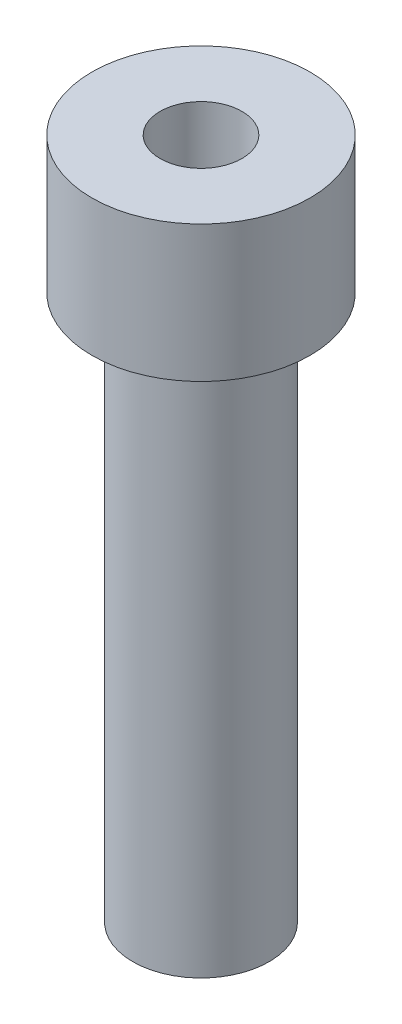
ISO-10303-21;
HEADER;
FILE_DESCRIPTION(('STEP AP214'),'2;1');
FILE_NAME('part.step','',(''),(''),'','','');
FILE_SCHEMA(('AUTOMOTIVE_DESIGN { 1 0 10303 214 1 1 1 1 }'));
ENDSEC;
DATA;
#1=APPLICATION_CONTEXT('core data for automotive mechanical design processes');
#2=APPLICATION_PROTOCOL_DEFINITION('international standard','automotive_design',2000,#1);
#3=PRODUCT_CONTEXT('',#1,'mechanical');
#4=PRODUCT('Part','Part','',(#3));
#5=PRODUCT_RELATED_PRODUCT_CATEGORY('part','',(#4));
#6=PRODUCT_DEFINITION_FORMATION('','',#4);
#7=PRODUCT_DEFINITION_CONTEXT('part definition',#1,'design');
#8=PRODUCT_DEFINITION('design','',#6,#7);
#9=PRODUCT_DEFINITION_SHAPE('','',#8);
#10=(LENGTH_UNIT() NAMED_UNIT(*) SI_UNIT(.MILLI.,.METRE.));
#11=(NAMED_UNIT(*) PLANE_ANGLE_UNIT() SI_UNIT($,.RADIAN.));
#12=(NAMED_UNIT(*) SI_UNIT($,.STERADIAN.) SOLID_ANGLE_UNIT());
#13=UNCERTAINTY_MEASURE_WITH_UNIT(LENGTH_MEASURE(1.E-05),#10,'distance_accuracy_value','');
#14=(GEOMETRIC_REPRESENTATION_CONTEXT(3) GLOBAL_UNCERTAINTY_ASSIGNED_CONTEXT((#13)) GLOBAL_UNIT_ASSIGNED_CONTEXT((#10,
#11,#12)) REPRESENTATION_CONTEXT('',''));
#15=CARTESIAN_POINT('',(0.,0.,0.));
#16=DIRECTION('',(0.,0.,1.));
#17=DIRECTION('',(1.,0.,0.));
#18=AXIS2_PLACEMENT_3D('',#15,#16,#17);
#19=CARTESIAN_POINT('',(0.,20.,0.));
#20=DIRECTION('',(0.,-1.,0.));
#21=DIRECTION('',(0.,0.,-1.));
#22=AXIS2_PLACEMENT_3D('',#19,#20,#21);
#23=CYLINDRICAL_SURFACE('',#22,2.5);
#24=CARTESIAN_POINT('',(0.,20.,0.));
#25=DIRECTION('',(0.,1.,0.));
#26=DIRECTION('',(0.,0.,1.));
#27=AXIS2_PLACEMENT_3D('',#24,#25,#26);
#28=CIRCLE('',#27,2.5);
#29=CARTESIAN_POINT('',(0.,20.,2.5));
#30=VERTEX_POINT('',#29);
#31=EDGE_CURVE('E10',#30,#30,#28,.T.);
#32=ORIENTED_EDGE('',*,*,#31,.F.);
#33=EDGE_LOOP('',(#32));
#34=FACE_BOUND('',#33,.T.);
#35=CARTESIAN_POINT('',(0.,0.,0.));
#36=DIRECTION('',(0.,1.,0.));
#37=DIRECTION('',(0.,0.,1.));
#38=AXIS2_PLACEMENT_3D('',#35,#36,#37);
#39=CIRCLE('',#38,2.5);
#40=CARTESIAN_POINT('',(0.,0.,2.5));
#41=VERTEX_POINT('',#40);
#42=EDGE_CURVE('E40',#41,#41,#39,.T.);
#43=ORIENTED_EDGE('',*,*,#42,.T.);
#44=EDGE_LOOP('',(#43));
#45=FACE_BOUND('',#44,.T.);
#46=ADVANCED_FACE('F37',(#34,#45),#23,.T.);
#47=CARTESIAN_POINT('',(0.,0.,0.));
#48=DIRECTION('',(0.,1.,0.));
#49=DIRECTION('',(0.,0.,1.));
#50=AXIS2_PLACEMENT_3D('',#47,#48,#49);
#51=PLANE('',#50);
#52=ORIENTED_EDGE('',*,*,#42,.F.);
#53=EDGE_LOOP('',(#52));
#54=FACE_BOUND('',#53,.T.);
#55=ADVANCED_FACE('F85',(#54),#51,.F.);
#56=CARTESIAN_POINT('',(0.,25.,0.));
#57=DIRECTION('',(0.,-1.,0.));
#58=DIRECTION('',(0.,0.,-1.));
#59=AXIS2_PLACEMENT_3D('',#56,#57,#58);
#60=CYLINDRICAL_SURFACE('',#59,4.);
#61=CARTESIAN_POINT('',(0.,25.,0.));
#62=DIRECTION('',(0.,1.,0.));
#63=DIRECTION('',(0.,0.,1.));
#64=AXIS2_PLACEMENT_3D('',#61,#62,#63);
#65=CIRCLE('',#64,4.);
#66=CARTESIAN_POINT('',(0.,25.,4.));
#67=VERTEX_POINT('',#66);
#68=EDGE_CURVE('E49',#67,#67,#65,.T.);
#69=ORIENTED_EDGE('',*,*,#68,.F.);
#70=EDGE_LOOP('',(#69));
#71=FACE_BOUND('',#70,.T.);
#72=CARTESIAN_POINT('',(0.,20.,0.));
#73=DIRECTION('',(0.,1.,0.));
#74=DIRECTION('',(0.,0.,1.));
#75=AXIS2_PLACEMENT_3D('',#72,#73,#74);
#76=CIRCLE('',#75,4.);
#77=CARTESIAN_POINT('',(0.,20.,4.));
#78=VERTEX_POINT('',#77);
#79=EDGE_CURVE('E51',#78,#78,#76,.T.);
#80=ORIENTED_EDGE('',*,*,#79,.T.);
#81=EDGE_LOOP('',(#80));
#82=FACE_BOUND('',#81,.T.);
#83=ADVANCED_FACE('F79',(#71,#82),#60,.T.);
#84=CARTESIAN_POINT('',(0.,25.,0.));
#85=DIRECTION('',(0.,1.,0.));
#86=DIRECTION('',(0.,0.,1.));
#87=AXIS2_PLACEMENT_3D('',#84,#85,#86);
#88=PLANE('',#87);
#89=CARTESIAN_POINT('',(0.,25.,0.));
#90=DIRECTION('',(0.,1.,0.));
#91=DIRECTION('',(0.,0.,1.));
#92=AXIS2_PLACEMENT_3D('',#89,#90,#91);
#93=CIRCLE('',#92,1.5);
#94=CARTESIAN_POINT('',(0.,25.,1.5));
#95=VERTEX_POINT('',#94);
#96=EDGE_CURVE('E59',#95,#95,#93,.T.);
#97=ORIENTED_EDGE('',*,*,#96,.F.);
#98=EDGE_LOOP('',(#97));
#99=FACE_BOUND('',#98,.T.);
#100=ORIENTED_EDGE('',*,*,#68,.T.);
#101=EDGE_LOOP('',(#100));
#102=FACE_BOUND('',#101,.T.);
#103=ADVANCED_FACE('F76',(#99,#102),#88,.T.);
#104=CARTESIAN_POINT('',(0.,20.,0.));
#105=DIRECTION('',(0.,1.,0.));
#106=DIRECTION('',(0.,0.,1.));
#107=AXIS2_PLACEMENT_3D('',#104,#105,#106);
#108=PLANE('',#107);
#109=ORIENTED_EDGE('',*,*,#31,.T.);
#110=EDGE_LOOP('',(#109));
#111=FACE_BOUND('',#110,.T.);
#112=ORIENTED_EDGE('',*,*,#79,.F.);
#113=EDGE_LOOP('',(#112));
#114=FACE_BOUND('',#113,.T.);
#115=ADVANCED_FACE('F72',(#111,#114),#108,.F.);
#116=CARTESIAN_POINT('',(0.,22.,0.));
#117=DIRECTION('',(0.,1.,0.));
#118=DIRECTION('',(0.,0.,1.));
#119=AXIS2_PLACEMENT_3D('',#116,#117,#118);
#120=CYLINDRICAL_SURFACE('',#119,1.5);
#121=CARTESIAN_POINT('',(0.,22.,0.));
#122=DIRECTION('',(0.,1.,0.));
#123=DIRECTION('',(0.,0.,1.));
#124=AXIS2_PLACEMENT_3D('',#121,#122,#123);
#125=CIRCLE('',#124,1.5);
#126=CARTESIAN_POINT('',(0.,22.,1.5));
#127=VERTEX_POINT('',#126);
#128=EDGE_CURVE('E55',#127,#127,#125,.T.);
#129=ORIENTED_EDGE('',*,*,#128,.F.);
#130=EDGE_LOOP('',(#129));
#131=FACE_BOUND('',#130,.T.);
#132=ORIENTED_EDGE('',*,*,#96,.T.);
#133=EDGE_LOOP('',(#132));
#134=FACE_BOUND('',#133,.T.);
#135=ADVANCED_FACE('F69',(#131,#134),#120,.F.);
#136=CARTESIAN_POINT('',(0.,22.,0.));
#137=DIRECTION('',(0.,1.,0.));
#138=DIRECTION('',(0.,0.,1.));
#139=AXIS2_PLACEMENT_3D('',#136,#137,#138);
#140=PLANE('',#139);
#141=ORIENTED_EDGE('',*,*,#128,.T.);
#142=EDGE_LOOP('',(#141));
#143=FACE_BOUND('',#142,.T.);
#144=ADVANCED_FACE('F67',(#143),#140,.T.);
#145=CLOSED_SHELL('',(#46,#55,#83,#103,#115,#135,#144));
#146=MANIFOLD_SOLID_BREP('B2',#145);
#147=ADVANCED_BREP_SHAPE_REPRESENTATION('',(#18,#146),#14);
#148=SHAPE_DEFINITION_REPRESENTATION(#9,#147);
ENDSEC;
END-ISO-10303-21;
